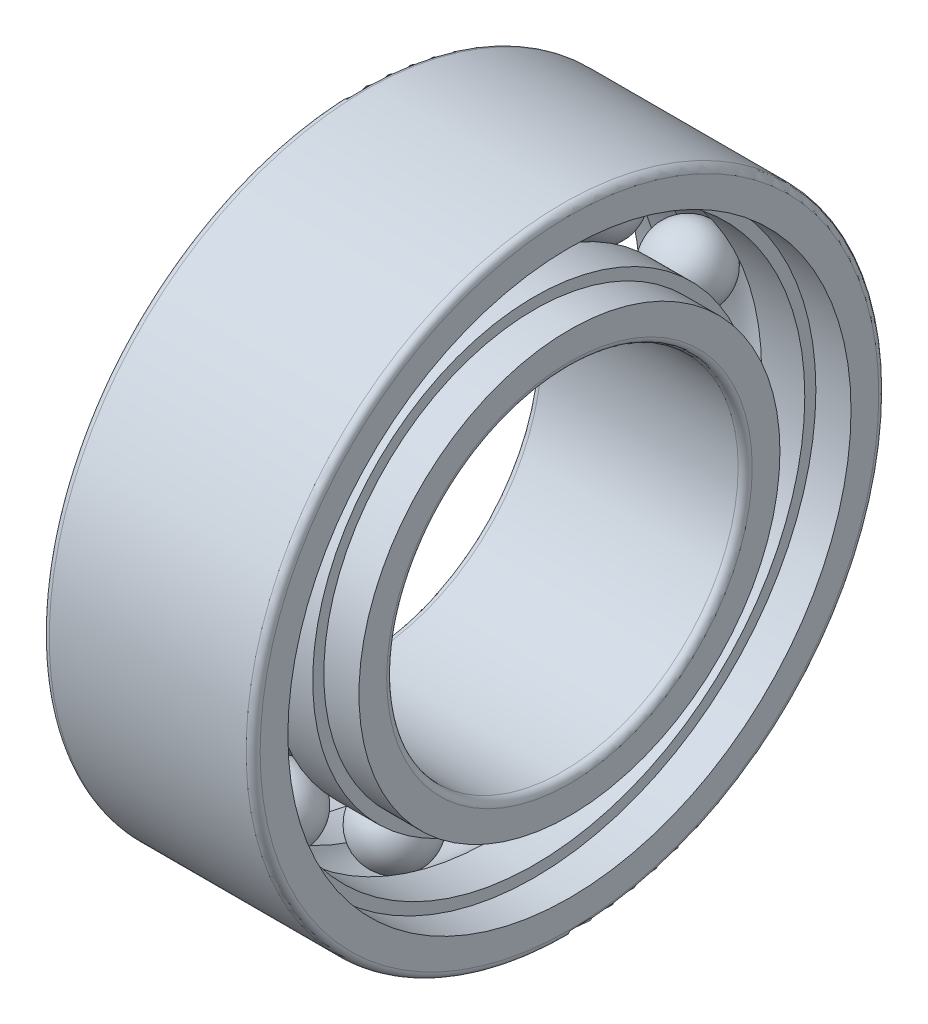
ISO-10303-21;
HEADER;
FILE_DESCRIPTION(('STEP AP214'),'2;1');
FILE_NAME('part.step','',(''),(''),'','','');
FILE_SCHEMA(('AUTOMOTIVE_DESIGN { 1 0 10303 214 1 1 1 1 }'));
ENDSEC;
DATA;
#1=APPLICATION_CONTEXT('core data for automotive mechanical design processes');
#2=APPLICATION_PROTOCOL_DEFINITION('international standard','automotive_design',2000,#1);
#3=PRODUCT_CONTEXT('',#1,'mechanical');
#4=PRODUCT('Part','Part','',(#3));
#5=PRODUCT_RELATED_PRODUCT_CATEGORY('part','',(#4));
#6=PRODUCT_DEFINITION_FORMATION('','',#4);
#7=PRODUCT_DEFINITION_CONTEXT('part definition',#1,'design');
#8=PRODUCT_DEFINITION('design','',#6,#7);
#9=PRODUCT_DEFINITION_SHAPE('','',#8);
#10=(LENGTH_UNIT() NAMED_UNIT(*) SI_UNIT(.MILLI.,.METRE.));
#11=(NAMED_UNIT(*) PLANE_ANGLE_UNIT() SI_UNIT($,.RADIAN.));
#12=(NAMED_UNIT(*) SI_UNIT($,.STERADIAN.) SOLID_ANGLE_UNIT());
#13=UNCERTAINTY_MEASURE_WITH_UNIT(LENGTH_MEASURE(1.E-05),#10,'distance_accuracy_value','');
#14=(GEOMETRIC_REPRESENTATION_CONTEXT(3) GLOBAL_UNCERTAINTY_ASSIGNED_CONTEXT((#13)) GLOBAL_UNIT_ASSIGNED_CONTEXT((#10,
#11,#12)) REPRESENTATION_CONTEXT('',''));
#15=CARTESIAN_POINT('',(0.,0.,0.));
#16=DIRECTION('',(0.,0.,1.));
#17=DIRECTION('',(1.,0.,0.));
#18=AXIS2_PLACEMENT_3D('',#15,#16,#17);
#19=CARTESIAN_POINT('',(1.5,-2.2920125688085,2.64512351023991));
#20=DIRECTION('',(1.,0.,0.));
#21=DIRECTION('',(0.,-0.654860733945285,0.755749574354259));
#22=AXIS2_PLACEMENT_3D('',#19,#20,#21);
#23=SPHERICAL_SURFACE('',#22,0.52);
#24=CARTESIAN_POINT('',(0.98,-2.2920125688085,2.64512351023991));
#25=VERTEX_POINT('',#24);
#26=VERTEX_LOOP('',#25);
#27=FACE_BOUND('',#26,.T.);
#28=CARTESIAN_POINT('',(2.02,-2.2920125688085,2.64512351023991));
#29=VERTEX_POINT('',#28);
#30=VERTEX_LOOP('',#29);
#31=FACE_BOUND('',#30,.T.);
#32=ADVANCED_FACE('P0_F15',(#27,#31),#23,.T.);
#33=CLOSED_SHELL('',(#32));
#34=MANIFOLD_SOLID_BREP('P0_B1',#33);
#35=CARTESIAN_POINT('',(1.5,2.94438736490914,-1.89224286109459));
#36=DIRECTION('',(1.,0.,0.));
#37=DIRECTION('',(0.,0.841253532831181,-0.540640817455598));
#38=AXIS2_PLACEMENT_3D('',#35,#36,#37);
#39=SPHERICAL_SURFACE('',#38,0.52);
#40=CARTESIAN_POINT('',(0.98,2.94438736490914,-1.89224286109459));
#41=VERTEX_POINT('',#40);
#42=VERTEX_LOOP('',#41);
#43=FACE_BOUND('',#42,.T.);
#44=CARTESIAN_POINT('',(2.02,2.94438736490914,-1.89224286109459));
#45=VERTEX_POINT('',#44);
#46=VERTEX_LOOP('',#45);
#47=FACE_BOUND('',#46,.T.);
#48=ADVANCED_FACE('P1_F15',(#43,#47),#39,.T.);
#49=CLOSED_SHELL('',(#48));
#50=MANIFOLD_SOLID_BREP('P1_B1',#49);
#51=CARTESIAN_POINT('',(1.5,-3.35822540765074,0.986063948945004));
#52=DIRECTION('',(1.,0.,0.));
#53=DIRECTION('',(0.,-0.959492973614497,0.28173255684143));
#54=AXIS2_PLACEMENT_3D('',#51,#52,#53);
#55=SPHERICAL_SURFACE('',#54,0.52);
#56=CARTESIAN_POINT('',(0.98,-3.35822540765074,0.986063948945004));
#57=VERTEX_POINT('',#56);
#58=VERTEX_LOOP('',#57);
#59=FACE_BOUND('',#58,.T.);
#60=CARTESIAN_POINT('',(2.02,-3.35822540765074,0.986063948945004));
#61=VERTEX_POINT('',#60);
#62=VERTEX_LOOP('',#61);
#63=FACE_BOUND('',#62,.T.);
#64=ADVANCED_FACE('P2_F15',(#59,#63),#55,.T.);
#65=CLOSED_SHELL('',(#64));
#66=MANIFOLD_SOLID_BREP('P2_B1',#65);
#67=CARTESIAN_POINT('',(1.5,-0.498101933956498,3.46437504658327));
#68=DIRECTION('',(1.,0.,0.));
#69=DIRECTION('',(0.,-0.142314838273285,0.989821441880933));
#70=AXIS2_PLACEMENT_3D('',#67,#68,#69);
#71=SPHERICAL_SURFACE('',#70,0.52);
#72=CARTESIAN_POINT('',(0.98,-0.498101933956498,3.46437504658327));
#73=VERTEX_POINT('',#72);
#74=VERTEX_LOOP('',#73);
#75=FACE_BOUND('',#74,.T.);
#76=CARTESIAN_POINT('',(2.02,-0.498101933956498,3.46437504658327));
#77=VERTEX_POINT('',#76);
#78=VERTEX_LOOP('',#77);
#79=FACE_BOUND('',#78,.T.);
#80=ADVANCED_FACE('P3_F15',(#75,#79),#71,.T.);
#81=CLOSED_SHELL('',(#80));
#82=MANIFOLD_SOLID_BREP('P3_B1',#81);
#83=CARTESIAN_POINT('',(1.5,0.,0.));
#84=DIRECTION('',(1.,0.,0.));
#85=DIRECTION('',(0.,0.,-1.));
#86=AXIS2_PLACEMENT_3D('',#83,#84,#85);
#87=TOROIDAL_SURFACE('',#86,3.5,0.52);
#88=CARTESIAN_POINT('',(1.11361159437685,0.,0.));
#89=DIRECTION('',(1.,0.,0.));
#90=DIRECTION('',(0.,0.,-1.));
#91=AXIS2_PLACEMENT_3D('',#88,#89,#90);
#92=CIRCLE('',#91,3.848);
#93=CARTESIAN_POINT('',(1.11361159437685,0.,-3.848));
#94=VERTEX_POINT('',#93);
#95=EDGE_CURVE('P4_E143',#94,#94,#92,.F.);
#96=ORIENTED_EDGE('',*,*,#95,.T.);
#97=EDGE_LOOP('',(#96));
#98=FACE_BOUND('',#97,.T.);
#99=CARTESIAN_POINT('',(1.88638840562315,0.,0.));
#100=DIRECTION('',(1.,0.,0.));
#101=DIRECTION('',(0.,0.,-1.));
#102=AXIS2_PLACEMENT_3D('',#99,#100,#101);
#103=CIRCLE('',#102,3.84800000000001);
#104=CARTESIAN_POINT('',(1.88638840562315,0.,-3.84800000000001));
#105=VERTEX_POINT('',#104);
#106=EDGE_CURVE('P4_E140',#105,#105,#103,.T.);
#107=ORIENTED_EDGE('',*,*,#106,.T.);
#108=EDGE_LOOP('',(#107));
#109=FACE_BOUND('',#108,.T.);
#110=ADVANCED_FACE('P4_F14',(#98,#109),#87,.F.);
#111=CARTESIAN_POINT('',(0.806805797188427,0.,0.));
#112=DIRECTION('',(1.,0.,0.));
#113=DIRECTION('',(0.,0.,-1.));
#114=AXIS2_PLACEMENT_3D('',#111,#112,#113);
#115=CYLINDRICAL_SURFACE('',#114,3.848);
#116=ORIENTED_EDGE('',*,*,#95,.F.);
#117=EDGE_LOOP('',(#116));
#118=FACE_BOUND('',#117,.T.);
#119=CARTESIAN_POINT('',(0.500000000000002,0.,0.));
#120=DIRECTION('',(1.,0.,0.));
#121=DIRECTION('',(0.,0.,-1.));
#122=AXIS2_PLACEMENT_3D('',#119,#120,#121);
#123=CIRCLE('',#122,3.848);
#124=CARTESIAN_POINT('',(0.500000000000002,0.,-3.848));
#125=VERTEX_POINT('',#124);
#126=EDGE_CURVE('P4_E18',#125,#125,#123,.T.);
#127=ORIENTED_EDGE('',*,*,#126,.F.);
#128=EDGE_LOOP('',(#127));
#129=FACE_BOUND('',#128,.T.);
#130=ADVANCED_FACE('P4_F101',(#118,#129),#115,.F.);
#131=CARTESIAN_POINT('',(2.19319420281158,0.,0.));
#132=DIRECTION('',(1.,0.,0.));
#133=DIRECTION('',(0.,0.,-1.));
#134=AXIS2_PLACEMENT_3D('',#131,#132,#133);
#135=CYLINDRICAL_SURFACE('',#134,3.84800000000001);
#136=CARTESIAN_POINT('',(2.50000000000001,0.,0.));
#137=DIRECTION('',(1.,0.,0.));
#138=DIRECTION('',(0.,0.,-1.));
#139=AXIS2_PLACEMENT_3D('',#136,#137,#138);
#140=CIRCLE('',#139,3.84800000000001);
#141=CARTESIAN_POINT('',(2.50000000000001,0.,-3.84800000000001));
#142=VERTEX_POINT('',#141);
#143=EDGE_CURVE('P4_E136',#142,#142,#140,.F.);
#144=ORIENTED_EDGE('',*,*,#143,.F.);
#145=EDGE_LOOP('',(#144));
#146=FACE_BOUND('',#145,.T.);
#147=ORIENTED_EDGE('',*,*,#106,.F.);
#148=EDGE_LOOP('',(#147));
#149=FACE_BOUND('',#148,.T.);
#150=ADVANCED_FACE('P4_F98',(#146,#149),#135,.F.);
#151=CARTESIAN_POINT('',(0.500000000000002,3.9268,0.));
#152=DIRECTION('',(-1.,0.,0.));
#153=DIRECTION('',(0.,0.,1.));
#154=AXIS2_PLACEMENT_3D('',#151,#152,#153);
#155=PLANE('',#154);
#156=ORIENTED_EDGE('',*,*,#126,.T.);
#157=EDGE_LOOP('',(#156));
#158=FACE_BOUND('',#157,.T.);
#159=CARTESIAN_POINT('',(0.500000000000002,0.,0.));
#160=DIRECTION('',(1.,0.,0.));
#161=DIRECTION('',(0.,0.,-1.));
#162=AXIS2_PLACEMENT_3D('',#159,#160,#161);
#163=CIRCLE('',#162,4.0056);
#164=CARTESIAN_POINT('',(0.500000000000002,0.,-4.0056));
#165=VERTEX_POINT('',#164);
#166=EDGE_CURVE('P4_E134',#165,#165,#163,.F.);
#167=ORIENTED_EDGE('',*,*,#166,.T.);
#168=EDGE_LOOP('',(#167));
#169=FACE_BOUND('',#168,.T.);
#170=ADVANCED_FACE('P4_F94',(#158,#169),#155,.T.);
#171=CARTESIAN_POINT('',(2.50000000000001,3.9268,0.));
#172=DIRECTION('',(1.,0.,0.));
#173=DIRECTION('',(0.,0.,-1.));
#174=AXIS2_PLACEMENT_3D('',#171,#172,#173);
#175=PLANE('',#174);
#176=ORIENTED_EDGE('',*,*,#143,.T.);
#177=EDGE_LOOP('',(#176));
#178=FACE_BOUND('',#177,.T.);
#179=CARTESIAN_POINT('',(2.50000000000001,0.,0.));
#180=DIRECTION('',(1.,0.,0.));
#181=DIRECTION('',(0.,0.,-1.));
#182=AXIS2_PLACEMENT_3D('',#179,#180,#181);
#183=CIRCLE('',#182,4.0056);
#184=CARTESIAN_POINT('',(2.50000000000001,0.,-4.0056));
#185=VERTEX_POINT('',#184);
#186=EDGE_CURVE('P4_E127',#185,#185,#183,.T.);
#187=ORIENTED_EDGE('',*,*,#186,.T.);
#188=EDGE_LOOP('',(#187));
#189=FACE_BOUND('',#188,.T.);
#190=ADVANCED_FACE('P4_F90',(#178,#189),#175,.T.);
#191=CARTESIAN_POINT('',(0.250000000000001,0.,0.));
#192=DIRECTION('',(1.,0.,0.));
#193=DIRECTION('',(0.,0.,-1.));
#194=AXIS2_PLACEMENT_3D('',#191,#192,#193);
#195=CYLINDRICAL_SURFACE('',#194,4.0056);
#196=ORIENTED_EDGE('',*,*,#166,.F.);
#197=EDGE_LOOP('',(#196));
#198=FACE_BOUND('',#197,.T.);
#199=CARTESIAN_POINT('',(0.,0.,0.));
#200=DIRECTION('',(1.,0.,0.));
#201=DIRECTION('',(0.,0.,-1.));
#202=AXIS2_PLACEMENT_3D('',#199,#200,#201);
#203=CIRCLE('',#202,4.0056);
#204=CARTESIAN_POINT('',(0.,0.,-4.0056));
#205=VERTEX_POINT('',#204);
#206=EDGE_CURVE('P4_E122',#205,#205,#203,.T.);
#207=ORIENTED_EDGE('',*,*,#206,.F.);
#208=EDGE_LOOP('',(#207));
#209=FACE_BOUND('',#208,.T.);
#210=ADVANCED_FACE('P4_F86',(#198,#209),#195,.F.);
#211=CARTESIAN_POINT('',(2.75000000000001,0.,0.));
#212=DIRECTION('',(1.,0.,0.));
#213=DIRECTION('',(0.,0.,-1.));
#214=AXIS2_PLACEMENT_3D('',#211,#212,#213);
#215=CYLINDRICAL_SURFACE('',#214,4.0056);
#216=CARTESIAN_POINT('',(3.00000000000001,0.,0.));
#217=DIRECTION('',(1.,0.,0.));
#218=DIRECTION('',(0.,0.,-1.));
#219=AXIS2_PLACEMENT_3D('',#216,#217,#218);
#220=CIRCLE('',#219,4.0056);
#221=CARTESIAN_POINT('',(3.00000000000001,0.,-4.0056));
#222=VERTEX_POINT('',#221);
#223=EDGE_CURVE('P4_E120',#222,#222,#220,.F.);
#224=ORIENTED_EDGE('',*,*,#223,.F.);
#225=EDGE_LOOP('',(#224));
#226=FACE_BOUND('',#225,.T.);
#227=ORIENTED_EDGE('',*,*,#186,.F.);
#228=EDGE_LOOP('',(#227));
#229=FACE_BOUND('',#228,.T.);
#230=ADVANCED_FACE('P4_F81',(#226,#229),#215,.F.);
#231=CARTESIAN_POINT('',(0.,4.2528,0.));
#232=DIRECTION('',(-1.,0.,0.));
#233=DIRECTION('',(0.,0.,1.));
#234=AXIS2_PLACEMENT_3D('',#231,#232,#233);
#235=PLANE('',#234);
#236=ORIENTED_EDGE('',*,*,#206,.T.);
#237=EDGE_LOOP('',(#236));
#238=FACE_BOUND('',#237,.T.);
#239=CARTESIAN_POINT('',(0.,0.,0.));
#240=DIRECTION('',(1.,0.,0.));
#241=DIRECTION('',(0.,1.,0.));
#242=AXIS2_PLACEMENT_3D('',#239,#240,#241);
#243=CIRCLE('',#242,4.4);
#244=CARTESIAN_POINT('',(0.,4.4,0.));
#245=VERTEX_POINT('',#244);
#246=EDGE_CURVE('P4_E65',#245,#245,#243,.T.);
#247=ORIENTED_EDGE('',*,*,#246,.F.);
#248=EDGE_LOOP('',(#247));
#249=FACE_BOUND('',#248,.T.);
#250=ADVANCED_FACE('P4_F71',(#238,#249),#235,.T.);
#251=CARTESIAN_POINT('',(3.00000000000001,4.2528,0.));
#252=DIRECTION('',(1.,0.,0.));
#253=DIRECTION('',(0.,0.,-1.));
#254=AXIS2_PLACEMENT_3D('',#251,#252,#253);
#255=PLANE('',#254);
#256=ORIENTED_EDGE('',*,*,#223,.T.);
#257=EDGE_LOOP('',(#256));
#258=FACE_BOUND('',#257,.T.);
#259=CARTESIAN_POINT('',(3.00000000000001,0.,0.));
#260=DIRECTION('',(-1.,0.,0.));
#261=DIRECTION('',(0.,1.,0.));
#262=AXIS2_PLACEMENT_3D('',#259,#260,#261);
#263=CIRCLE('',#262,4.4);
#264=CARTESIAN_POINT('',(3.00000000000001,4.4,0.));
#265=VERTEX_POINT('',#264);
#266=EDGE_CURVE('P4_E27',#265,#265,#263,.T.);
#267=ORIENTED_EDGE('',*,*,#266,.F.);
#268=EDGE_LOOP('',(#267));
#269=FACE_BOUND('',#268,.T.);
#270=ADVANCED_FACE('P4_F80',(#258,#269),#255,.T.);
#271=CARTESIAN_POINT('',(0.0999999999999998,0.,0.));
#272=DIRECTION('',(1.,0.,0.));
#273=DIRECTION('',(0.,0.,-1.));
#274=AXIS2_PLACEMENT_3D('',#271,#272,#273);
#275=TOROIDAL_SURFACE('',#274,4.4,0.1);
#276=CARTESIAN_POINT('',(0.0999999999999998,0.,0.));
#277=DIRECTION('',(1.,0.,0.));
#278=DIRECTION('',(0.,0.,-1.));
#279=AXIS2_PLACEMENT_3D('',#276,#277,#278);
#280=CIRCLE('',#279,4.5);
#281=CARTESIAN_POINT('',(0.0999999999999998,0.,-4.5));
#282=VERTEX_POINT('',#281);
#283=EDGE_CURVE('P4_E22',#282,#282,#280,.T.);
#284=ORIENTED_EDGE('',*,*,#283,.F.);
#285=EDGE_LOOP('',(#284));
#286=FACE_BOUND('',#285,.T.);
#287=ORIENTED_EDGE('',*,*,#246,.T.);
#288=EDGE_LOOP('',(#287));
#289=FACE_BOUND('',#288,.T.);
#290=ADVANCED_FACE('P4_F45',(#286,#289),#275,.T.);
#291=CARTESIAN_POINT('',(2.90000000000001,0.,0.));
#292=DIRECTION('',(1.,0.,0.));
#293=DIRECTION('',(0.,0.,-1.));
#294=AXIS2_PLACEMENT_3D('',#291,#292,#293);
#295=TOROIDAL_SURFACE('',#294,4.4,0.1);
#296=ORIENTED_EDGE('',*,*,#266,.T.);
#297=EDGE_LOOP('',(#296));
#298=FACE_BOUND('',#297,.T.);
#299=CARTESIAN_POINT('',(2.90000000000001,0.,0.));
#300=DIRECTION('',(1.,0.,0.));
#301=DIRECTION('',(0.,0.,-1.));
#302=AXIS2_PLACEMENT_3D('',#299,#300,#301);
#303=CIRCLE('',#302,4.5);
#304=CARTESIAN_POINT('',(2.90000000000001,0.,-4.5));
#305=VERTEX_POINT('',#304);
#306=EDGE_CURVE('P4_E10',#305,#305,#303,.F.);
#307=ORIENTED_EDGE('',*,*,#306,.F.);
#308=EDGE_LOOP('',(#307));
#309=FACE_BOUND('',#308,.T.);
#310=ADVANCED_FACE('P4_F39',(#298,#309),#295,.T.);
#311=CARTESIAN_POINT('',(2.00000000000001,0.,0.));
#312=DIRECTION('',(1.,0.,0.));
#313=DIRECTION('',(0.,0.,-1.));
#314=AXIS2_PLACEMENT_3D('',#311,#312,#313);
#315=CYLINDRICAL_SURFACE('',#314,4.5);
#316=ORIENTED_EDGE('',*,*,#306,.T.);
#317=EDGE_LOOP('',(#316));
#318=FACE_BOUND('',#317,.T.);
#319=ORIENTED_EDGE('',*,*,#283,.T.);
#320=EDGE_LOOP('',(#319));
#321=FACE_BOUND('',#320,.T.);
#322=ADVANCED_FACE('P4_F44',(#318,#321),#315,.T.);
#323=CLOSED_SHELL('',(#110,#130,#150,#170,#190,#210,#230,#250,#270,#290,#310,#322));
#324=MANIFOLD_SOLID_BREP('P4_B1',#323);
#325=CARTESIAN_POINT('',(1.5,3.5,0.));
#326=DIRECTION('',(1.,0.,0.));
#327=DIRECTION('',(0.,1.,0.));
#328=AXIS2_PLACEMENT_3D('',#325,#326,#327);
#329=SPHERICAL_SURFACE('',#328,0.52);
#330=CARTESIAN_POINT('',(0.98,3.5,0.));
#331=VERTEX_POINT('',#330);
#332=VERTEX_LOOP('',#331);
#333=FACE_BOUND('',#332,.T.);
#334=CARTESIAN_POINT('',(2.02,3.5,0.));
#335=VERTEX_POINT('',#334);
#336=VERTEX_LOOP('',#335);
#337=FACE_BOUND('',#336,.T.);
#338=ADVANCED_FACE('P5_F15',(#333,#337),#329,.T.);
#339=CLOSED_SHELL('',(#338));
#340=MANIFOLD_SOLID_BREP('P5_B1',#339);
#341=CARTESIAN_POINT('',(1.5,-2.2920125688085,-2.6451235102399));
#342=DIRECTION('',(1.,0.,0.));
#343=DIRECTION('',(0.,-0.654860733945285,-0.755749574354258));
#344=AXIS2_PLACEMENT_3D('',#341,#342,#343);
#345=SPHERICAL_SURFACE('',#344,0.52);
#346=CARTESIAN_POINT('',(0.98,-2.2920125688085,-2.6451235102399));
#347=VERTEX_POINT('',#346);
#348=VERTEX_LOOP('',#347);
#349=FACE_BOUND('',#348,.T.);
#350=CARTESIAN_POINT('',(2.02,-2.2920125688085,-2.6451235102399));
#351=VERTEX_POINT('',#350);
#352=VERTEX_LOOP('',#351);
#353=FACE_BOUND('',#352,.T.);
#354=ADVANCED_FACE('P6_F15',(#349,#353),#345,.T.);
#355=CLOSED_SHELL('',(#354));
#356=MANIFOLD_SOLID_BREP('P6_B1',#355);
#357=CARTESIAN_POINT('',(1.5,-3.35822540765074,-0.986063948945003));
#358=DIRECTION('',(1.,0.,0.));
#359=DIRECTION('',(0.,-0.959492973614497,-0.28173255684143));
#360=AXIS2_PLACEMENT_3D('',#357,#358,#359);
#361=SPHERICAL_SURFACE('',#360,0.52);
#362=CARTESIAN_POINT('',(0.98,-3.35822540765074,-0.986063948945003));
#363=VERTEX_POINT('',#362);
#364=VERTEX_LOOP('',#363);
#365=FACE_BOUND('',#364,.T.);
#366=CARTESIAN_POINT('',(2.02,-3.35822540765074,-0.986063948945003));
#367=VERTEX_POINT('',#366);
#368=VERTEX_LOOP('',#367);
#369=FACE_BOUND('',#368,.T.);
#370=ADVANCED_FACE('P7_F15',(#365,#369),#361,.T.);
#371=CLOSED_SHELL('',(#370));
#372=MANIFOLD_SOLID_BREP('P7_B1',#371);
#373=CARTESIAN_POINT('',(1.5,0.,0.));
#374=DIRECTION('',(1.,0.,0.));
#375=DIRECTION('',(0.,0.,-1.));
#376=AXIS2_PLACEMENT_3D('',#373,#374,#375);
#377=TOROIDAL_SURFACE('',#376,3.5,0.52);
#378=CARTESIAN_POINT('',(1.11361159437685,0.,0.));
#379=DIRECTION('',(1.,0.,0.));
#380=DIRECTION('',(0.,0.,-1.));
#381=AXIS2_PLACEMENT_3D('',#378,#379,#380);
#382=CIRCLE('',#381,3.152);
#383=CARTESIAN_POINT('',(1.11361159437685,0.,-3.152));
#384=VERTEX_POINT('',#383);
#385=EDGE_CURVE('P8_E141',#384,#384,#382,.F.);
#386=ORIENTED_EDGE('',*,*,#385,.F.);
#387=EDGE_LOOP('',(#386));
#388=FACE_BOUND('',#387,.T.);
#389=CARTESIAN_POINT('',(1.88638840562315,0.,0.));
#390=DIRECTION('',(1.,0.,0.));
#391=DIRECTION('',(0.,0.,-1.));
#392=AXIS2_PLACEMENT_3D('',#389,#390,#391);
#393=CIRCLE('',#392,3.152);
#394=CARTESIAN_POINT('',(1.88638840562315,0.,-3.152));
#395=VERTEX_POINT('',#394);
#396=EDGE_CURVE('P8_E145',#395,#395,#393,.T.);
#397=ORIENTED_EDGE('',*,*,#396,.F.);
#398=EDGE_LOOP('',(#397));
#399=FACE_BOUND('',#398,.T.);
#400=ADVANCED_FACE('P8_F14',(#388,#399),#377,.F.);
#401=CARTESIAN_POINT('',(2.19319420281158,0.,0.));
#402=DIRECTION('',(1.,0.,0.));
#403=DIRECTION('',(0.,0.,-1.));
#404=AXIS2_PLACEMENT_3D('',#401,#402,#403);
#405=CYLINDRICAL_SURFACE('',#404,3.152);
#406=ORIENTED_EDGE('',*,*,#396,.T.);
#407=EDGE_LOOP('',(#406));
#408=FACE_BOUND('',#407,.T.);
#409=CARTESIAN_POINT('',(2.50000000000001,0.,0.));
#410=DIRECTION('',(1.,0.,0.));
#411=DIRECTION('',(0.,0.,-1.));
#412=AXIS2_PLACEMENT_3D('',#409,#410,#411);
#413=CIRCLE('',#412,3.152);
#414=CARTESIAN_POINT('',(2.50000000000001,0.,-3.152));
#415=VERTEX_POINT('',#414);
#416=EDGE_CURVE('P8_E18',#415,#415,#413,.T.);
#417=ORIENTED_EDGE('',*,*,#416,.F.);
#418=EDGE_LOOP('',(#417));
#419=FACE_BOUND('',#418,.T.);
#420=ADVANCED_FACE('P8_F100',(#408,#419),#405,.T.);
#421=CARTESIAN_POINT('',(0.806805797188427,0.,0.));
#422=DIRECTION('',(1.,0.,0.));
#423=DIRECTION('',(0.,0.,-1.));
#424=AXIS2_PLACEMENT_3D('',#421,#422,#423);
#425=CYLINDRICAL_SURFACE('',#424,3.152);
#426=CARTESIAN_POINT('',(0.500000000000003,0.,0.));
#427=DIRECTION('',(1.,0.,0.));
#428=DIRECTION('',(0.,0.,-1.));
#429=AXIS2_PLACEMENT_3D('',#426,#427,#428);
#430=CIRCLE('',#429,3.152);
#431=CARTESIAN_POINT('',(0.500000000000003,0.,-3.152));
#432=VERTEX_POINT('',#431);
#433=EDGE_CURVE('P8_E136',#432,#432,#430,.F.);
#434=ORIENTED_EDGE('',*,*,#433,.F.);
#435=EDGE_LOOP('',(#434));
#436=FACE_BOUND('',#435,.T.);
#437=ORIENTED_EDGE('',*,*,#385,.T.);
#438=EDGE_LOOP('',(#437));
#439=FACE_BOUND('',#438,.T.);
#440=ADVANCED_FACE('P8_F97',(#436,#439),#425,.T.);
#441=CARTESIAN_POINT('',(2.50000000000001,3.0732,0.));
#442=DIRECTION('',(1.,0.,0.));
#443=DIRECTION('',(0.,0.,-1.));
#444=AXIS2_PLACEMENT_3D('',#441,#442,#443);
#445=PLANE('',#444);
#446=CARTESIAN_POINT('',(2.50000000000001,0.,0.));
#447=DIRECTION('',(1.,0.,0.));
#448=DIRECTION('',(0.,0.,-1.));
#449=AXIS2_PLACEMENT_3D('',#446,#447,#448);
#450=CIRCLE('',#449,2.9944);
#451=CARTESIAN_POINT('',(2.50000000000001,0.,-2.9944));
#452=VERTEX_POINT('',#451);
#453=EDGE_CURVE('P8_E134',#452,#452,#450,.T.);
#454=ORIENTED_EDGE('',*,*,#453,.F.);
#455=EDGE_LOOP('',(#454));
#456=FACE_BOUND('',#455,.T.);
#457=ORIENTED_EDGE('',*,*,#416,.T.);
#458=EDGE_LOOP('',(#457));
#459=FACE_BOUND('',#458,.T.);
#460=ADVANCED_FACE('P8_F93',(#456,#459),#445,.T.);
#461=CARTESIAN_POINT('',(0.500000000000003,3.0732,0.));
#462=DIRECTION('',(-1.,0.,0.));
#463=DIRECTION('',(0.,0.,1.));
#464=AXIS2_PLACEMENT_3D('',#461,#462,#463);
#465=PLANE('',#464);
#466=CARTESIAN_POINT('',(0.500000000000003,0.,0.));
#467=DIRECTION('',(1.,0.,0.));
#468=DIRECTION('',(0.,0.,-1.));
#469=AXIS2_PLACEMENT_3D('',#466,#467,#468);
#470=CIRCLE('',#469,2.9944);
#471=CARTESIAN_POINT('',(0.500000000000003,0.,-2.9944));
#472=VERTEX_POINT('',#471);
#473=EDGE_CURVE('P8_E127',#472,#472,#470,.F.);
#474=ORIENTED_EDGE('',*,*,#473,.F.);
#475=EDGE_LOOP('',(#474));
#476=FACE_BOUND('',#475,.T.);
#477=ORIENTED_EDGE('',*,*,#433,.T.);
#478=EDGE_LOOP('',(#477));
#479=FACE_BOUND('',#478,.T.);
#480=ADVANCED_FACE('P8_F89',(#476,#479),#465,.T.);
#481=CARTESIAN_POINT('',(2.75000000000001,0.,0.));
#482=DIRECTION('',(1.,0.,0.));
#483=DIRECTION('',(0.,0.,-1.));
#484=AXIS2_PLACEMENT_3D('',#481,#482,#483);
#485=CYLINDRICAL_SURFACE('',#484,2.9944);
#486=ORIENTED_EDGE('',*,*,#453,.T.);
#487=EDGE_LOOP('',(#486));
#488=FACE_BOUND('',#487,.T.);
#489=CARTESIAN_POINT('',(3.00000000000001,0.,0.));
#490=DIRECTION('',(1.,0.,0.));
#491=DIRECTION('',(0.,0.,-1.));
#492=AXIS2_PLACEMENT_3D('',#489,#490,#491);
#493=CIRCLE('',#492,2.9944);
#494=CARTESIAN_POINT('',(3.00000000000001,0.,-2.9944));
#495=VERTEX_POINT('',#494);
#496=EDGE_CURVE('P8_E122',#495,#495,#493,.T.);
#497=ORIENTED_EDGE('',*,*,#496,.F.);
#498=EDGE_LOOP('',(#497));
#499=FACE_BOUND('',#498,.T.);
#500=ADVANCED_FACE('P8_F85',(#488,#499),#485,.T.);
#501=CARTESIAN_POINT('',(0.250000000000001,0.,0.));
#502=DIRECTION('',(1.,0.,0.));
#503=DIRECTION('',(0.,0.,-1.));
#504=AXIS2_PLACEMENT_3D('',#501,#502,#503);
#505=CYLINDRICAL_SURFACE('',#504,2.9944);
#506=CARTESIAN_POINT('',(0.,0.,0.));
#507=DIRECTION('',(1.,0.,0.));
#508=DIRECTION('',(0.,0.,-1.));
#509=AXIS2_PLACEMENT_3D('',#506,#507,#508);
#510=CIRCLE('',#509,2.9944);
#511=CARTESIAN_POINT('',(0.,0.,-2.9944));
#512=VERTEX_POINT('',#511);
#513=EDGE_CURVE('P8_E120',#512,#512,#510,.F.);
#514=ORIENTED_EDGE('',*,*,#513,.F.);
#515=EDGE_LOOP('',(#514));
#516=FACE_BOUND('',#515,.T.);
#517=ORIENTED_EDGE('',*,*,#473,.T.);
#518=EDGE_LOOP('',(#517));
#519=FACE_BOUND('',#518,.T.);
#520=ADVANCED_FACE('P8_F81',(#516,#519),#505,.T.);
#521=CARTESIAN_POINT('',(3.00000000000001,2.7472,0.));
#522=DIRECTION('',(1.,0.,0.));
#523=DIRECTION('',(0.,0.,-1.));
#524=AXIS2_PLACEMENT_3D('',#521,#522,#523);
#525=PLANE('',#524);
#526=CARTESIAN_POINT('',(3.00000000000001,0.,0.));
#527=DIRECTION('',(1.,0.,0.));
#528=DIRECTION('',(0.,1.,0.));
#529=AXIS2_PLACEMENT_3D('',#526,#527,#528);
#530=CIRCLE('',#529,2.6);
#531=CARTESIAN_POINT('',(3.00000000000001,2.6,0.));
#532=VERTEX_POINT('',#531);
#533=EDGE_CURVE('P8_E65',#532,#532,#530,.T.);
#534=ORIENTED_EDGE('',*,*,#533,.F.);
#535=EDGE_LOOP('',(#534));
#536=FACE_BOUND('',#535,.T.);
#537=ORIENTED_EDGE('',*,*,#496,.T.);
#538=EDGE_LOOP('',(#537));
#539=FACE_BOUND('',#538,.T.);
#540=ADVANCED_FACE('P8_F71',(#536,#539),#525,.T.);
#541=CARTESIAN_POINT('',(0.,2.7472,0.));
#542=DIRECTION('',(-1.,0.,0.));
#543=DIRECTION('',(0.,0.,1.));
#544=AXIS2_PLACEMENT_3D('',#541,#542,#543);
#545=PLANE('',#544);
#546=CARTESIAN_POINT('',(0.,0.,0.));
#547=DIRECTION('',(-1.,0.,0.));
#548=DIRECTION('',(0.,1.,0.));
#549=AXIS2_PLACEMENT_3D('',#546,#547,#548);
#550=CIRCLE('',#549,2.6);
#551=CARTESIAN_POINT('',(0.,2.6,0.));
#552=VERTEX_POINT('',#551);
#553=EDGE_CURVE('P8_E27',#552,#552,#550,.T.);
#554=ORIENTED_EDGE('',*,*,#553,.F.);
#555=EDGE_LOOP('',(#554));
#556=FACE_BOUND('',#555,.T.);
#557=ORIENTED_EDGE('',*,*,#513,.T.);
#558=EDGE_LOOP('',(#557));
#559=FACE_BOUND('',#558,.T.);
#560=ADVANCED_FACE('P8_F80',(#556,#559),#545,.T.);
#561=CARTESIAN_POINT('',(2.90000000000001,0.,0.));
#562=DIRECTION('',(1.,0.,0.));
#563=DIRECTION('',(0.,0.,-1.));
#564=AXIS2_PLACEMENT_3D('',#561,#562,#563);
#565=TOROIDAL_SURFACE('',#564,2.6,0.1);
#566=CARTESIAN_POINT('',(2.90000000000001,0.,0.));
#567=DIRECTION('',(1.,0.,0.));
#568=DIRECTION('',(0.,0.,-1.));
#569=AXIS2_PLACEMENT_3D('',#566,#567,#568);
#570=CIRCLE('',#569,2.5);
#571=CARTESIAN_POINT('',(2.90000000000001,0.,-2.5));
#572=VERTEX_POINT('',#571);
#573=EDGE_CURVE('P8_E22',#572,#572,#570,.F.);
#574=ORIENTED_EDGE('',*,*,#573,.T.);
#575=EDGE_LOOP('',(#574));
#576=FACE_BOUND('',#575,.T.);
#577=ORIENTED_EDGE('',*,*,#533,.T.);
#578=EDGE_LOOP('',(#577));
#579=FACE_BOUND('',#578,.T.);
#580=ADVANCED_FACE('P8_F45',(#576,#579),#565,.T.);
#581=CARTESIAN_POINT('',(0.1,0.,0.));
#582=DIRECTION('',(1.,0.,0.));
#583=DIRECTION('',(0.,0.,-1.));
#584=AXIS2_PLACEMENT_3D('',#581,#582,#583);
#585=TOROIDAL_SURFACE('',#584,2.6,0.1);
#586=ORIENTED_EDGE('',*,*,#553,.T.);
#587=EDGE_LOOP('',(#586));
#588=FACE_BOUND('',#587,.T.);
#589=CARTESIAN_POINT('',(0.1,0.,0.));
#590=DIRECTION('',(1.,0.,0.));
#591=DIRECTION('',(0.,0.,-1.));
#592=AXIS2_PLACEMENT_3D('',#589,#590,#591);
#593=CIRCLE('',#592,2.5);
#594=CARTESIAN_POINT('',(0.1,0.,-2.5));
#595=VERTEX_POINT('',#594);
#596=EDGE_CURVE('P8_E10',#595,#595,#593,.T.);
#597=ORIENTED_EDGE('',*,*,#596,.T.);
#598=EDGE_LOOP('',(#597));
#599=FACE_BOUND('',#598,.T.);
#600=ADVANCED_FACE('P8_F39',(#588,#599),#585,.T.);
#601=CARTESIAN_POINT('',(1.5,0.,0.));
#602=DIRECTION('',(1.,0.,0.));
#603=DIRECTION('',(0.,0.,-1.));
#604=AXIS2_PLACEMENT_3D('',#601,#602,#603);
#605=CYLINDRICAL_SURFACE('',#604,2.5);
#606=ORIENTED_EDGE('',*,*,#596,.F.);
#607=EDGE_LOOP('',(#606));
#608=FACE_BOUND('',#607,.T.);
#609=ORIENTED_EDGE('',*,*,#573,.F.);
#610=EDGE_LOOP('',(#609));
#611=FACE_BOUND('',#610,.T.);
#612=ADVANCED_FACE('P8_F44',(#608,#611),#605,.F.);
#613=CLOSED_SHELL('',(#400,#420,#440,#460,#480,#500,#520,#540,#560,#580,#600,#612));
#614=MANIFOLD_SOLID_BREP('P8_B1',#613);
#615=CARTESIAN_POINT('',(1.5,1.4539525455066,-3.18371198374082));
#616=DIRECTION('',(1.,0.,0.));
#617=DIRECTION('',(0.,0.415415013001886,-0.909631995354519));
#618=AXIS2_PLACEMENT_3D('',#615,#616,#617);
#619=SPHERICAL_SURFACE('',#618,0.52);
#620=CARTESIAN_POINT('',(0.98,1.4539525455066,-3.18371198374082));
#621=VERTEX_POINT('',#620);
#622=VERTEX_LOOP('',#621);
#623=FACE_BOUND('',#622,.T.);
#624=CARTESIAN_POINT('',(2.02,1.4539525455066,-3.18371198374082));
#625=VERTEX_POINT('',#624);
#626=VERTEX_LOOP('',#625);
#627=FACE_BOUND('',#626,.T.);
#628=ADVANCED_FACE('P9_F15',(#623,#627),#619,.T.);
#629=CLOSED_SHELL('',(#628));
#630=MANIFOLD_SOLID_BREP('P9_B1',#629);
#631=CARTESIAN_POINT('',(1.5,2.94438736490914,1.89224286109459));
#632=DIRECTION('',(1.,0.,0.));
#633=DIRECTION('',(0.,0.841253532831181,0.540640817455598));
#634=AXIS2_PLACEMENT_3D('',#631,#632,#633);
#635=SPHERICAL_SURFACE('',#634,0.52);
#636=CARTESIAN_POINT('',(0.98,2.94438736490914,1.89224286109459));
#637=VERTEX_POINT('',#636);
#638=VERTEX_LOOP('',#637);
#639=FACE_BOUND('',#638,.T.);
#640=CARTESIAN_POINT('',(2.02,2.94438736490914,1.89224286109459));
#641=VERTEX_POINT('',#640);
#642=VERTEX_LOOP('',#641);
#643=FACE_BOUND('',#642,.T.);
#644=ADVANCED_FACE('P10_F15',(#639,#643),#635,.T.);
#645=CLOSED_SHELL('',(#644));
#646=MANIFOLD_SOLID_BREP('P10_B1',#645);
#647=CARTESIAN_POINT('',(1.5,1.4539525455066,3.18371198374082));
#648=DIRECTION('',(1.,0.,0.));
#649=DIRECTION('',(0.,0.415415013001886,0.909631995354519));
#650=AXIS2_PLACEMENT_3D('',#647,#648,#649);
#651=SPHERICAL_SURFACE('',#650,0.52);
#652=CARTESIAN_POINT('',(0.98,1.4539525455066,3.18371198374082));
#653=VERTEX_POINT('',#652);
#654=VERTEX_LOOP('',#653);
#655=FACE_BOUND('',#654,.T.);
#656=CARTESIAN_POINT('',(2.02,1.4539525455066,3.18371198374082));
#657=VERTEX_POINT('',#656);
#658=VERTEX_LOOP('',#657);
#659=FACE_BOUND('',#658,.T.);
#660=ADVANCED_FACE('P11_F15',(#655,#659),#651,.T.);
#661=CLOSED_SHELL('',(#660));
#662=MANIFOLD_SOLID_BREP('P11_B1',#661);
#663=CARTESIAN_POINT('',(1.5,-0.498101933956498,-3.46437504658327));
#664=DIRECTION('',(1.,0.,0.));
#665=DIRECTION('',(0.,-0.142314838273285,-0.989821441880933));
#666=AXIS2_PLACEMENT_3D('',#663,#664,#665);
#667=SPHERICAL_SURFACE('',#666,0.52);
#668=CARTESIAN_POINT('',(0.98,-0.498101933956498,-3.46437504658327));
#669=VERTEX_POINT('',#668);
#670=VERTEX_LOOP('',#669);
#671=FACE_BOUND('',#670,.T.);
#672=CARTESIAN_POINT('',(2.02,-0.498101933956498,-3.46437504658327));
#673=VERTEX_POINT('',#672);
#674=VERTEX_LOOP('',#673);
#675=FACE_BOUND('',#674,.T.);
#676=ADVANCED_FACE('P12_F15',(#671,#675),#667,.T.);
#677=CLOSED_SHELL('',(#676));
#678=MANIFOLD_SOLID_BREP('P12_B1',#677);
#679=ADVANCED_BREP_SHAPE_REPRESENTATION('',(#18,#34,#50,#66,#82,#324,#340,#356,#372,#614,#630,
#646,#662,#678),#14);
#680=SHAPE_DEFINITION_REPRESENTATION(#9,#679);
ENDSEC;
END-ISO-10303-21;
